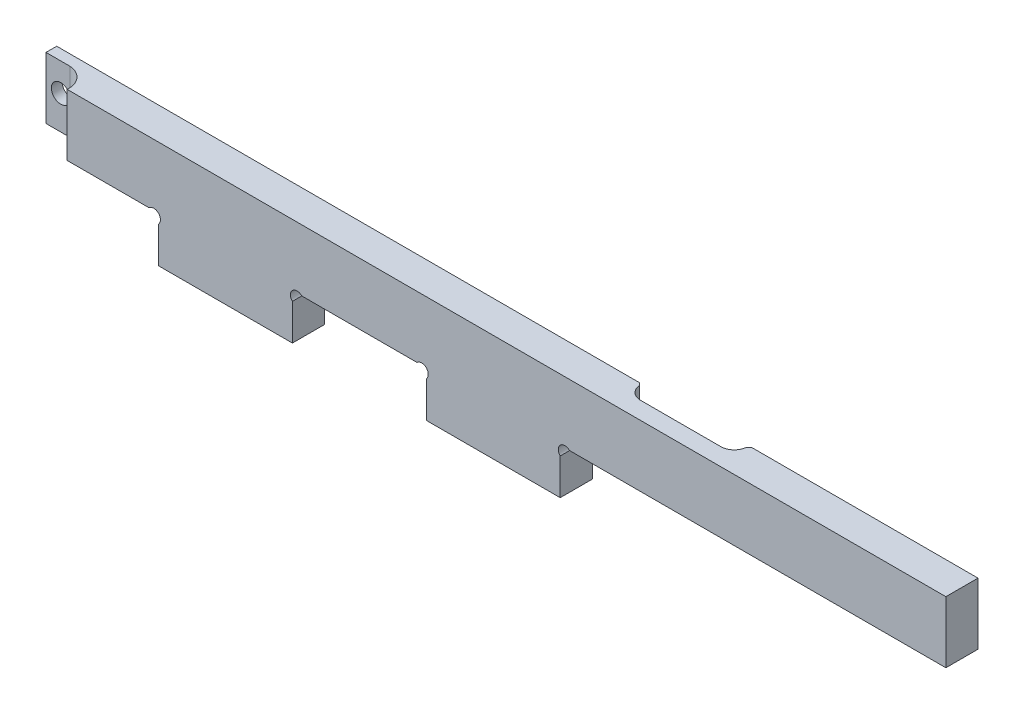
ISO-10303-21;
HEADER;
FILE_DESCRIPTION(('STEP AP214'),'2;1');
FILE_NAME('part.step','',(''),(''),'','','');
FILE_SCHEMA(('AUTOMOTIVE_DESIGN { 1 0 10303 214 1 1 1 1 }'));
ENDSEC;
DATA;
#1=APPLICATION_CONTEXT('core data for automotive mechanical design processes');
#2=APPLICATION_PROTOCOL_DEFINITION('international standard','automotive_design',2000,#1);
#3=PRODUCT_CONTEXT('',#1,'mechanical');
#4=PRODUCT('Part','Part','',(#3));
#5=PRODUCT_RELATED_PRODUCT_CATEGORY('part','',(#4));
#6=PRODUCT_DEFINITION_FORMATION('','',#4);
#7=PRODUCT_DEFINITION_CONTEXT('part definition',#1,'design');
#8=PRODUCT_DEFINITION('design','',#6,#7);
#9=PRODUCT_DEFINITION_SHAPE('','',#8);
#10=(LENGTH_UNIT() NAMED_UNIT(*) SI_UNIT(.MILLI.,.METRE.));
#11=(NAMED_UNIT(*) PLANE_ANGLE_UNIT() SI_UNIT($,.RADIAN.));
#12=(NAMED_UNIT(*) SI_UNIT($,.STERADIAN.) SOLID_ANGLE_UNIT());
#13=UNCERTAINTY_MEASURE_WITH_UNIT(LENGTH_MEASURE(1.E-05),#10,'distance_accuracy_value','');
#14=(GEOMETRIC_REPRESENTATION_CONTEXT(3) GLOBAL_UNCERTAINTY_ASSIGNED_CONTEXT((#13)) GLOBAL_UNIT_ASSIGNED_CONTEXT((#10,
#11,#12)) REPRESENTATION_CONTEXT('',''));
#15=CARTESIAN_POINT('',(0.,0.,0.));
#16=DIRECTION('',(0.,0.,1.));
#17=DIRECTION('',(1.,0.,0.));
#18=AXIS2_PLACEMENT_3D('',#15,#16,#17);
#19=CARTESIAN_POINT('',(-79.412979966611,24.8772522522521,0.));
#20=DIRECTION('',(0.,0.,-1.));
#21=DIRECTION('',(-1.,0.,0.));
#22=AXIS2_PLACEMENT_3D('',#19,#20,#21);
#23=PLANE('',#22);
#24=CARTESIAN_POINT('',(-122.162979966611,39.1272522522534,0.));
#25=DIRECTION('',(0.,0.,-1.));
#26=DIRECTION('',(-1.,0.,0.));
#27=AXIS2_PLACEMENT_3D('',#24,#25,#26);
#28=CIRCLE('',#27,3.50000000000001);
#29=CARTESIAN_POINT('',(-125.662979966611,39.1272522522534,0.));
#30=VERTEX_POINT('',#29);
#31=EDGE_CURVE('E208',#30,#30,#28,.T.);
#32=ORIENTED_EDGE('',*,*,#31,.F.);
#33=EDGE_LOOP('',(#32));
#34=FACE_BOUND('',#33,.T.);
#35=DIRECTION('',(-1.,0.,0.));
#36=VECTOR('',#35,1.);
#37=CARTESIAN_POINT('',(-127.662979966611,49.6272522522523,0.));
#38=LINE('',#37,#36);
#39=CARTESIAN_POINT('',(89.8578896618382,49.6272522522522,0.));
#40=VERTEX_POINT('',#39);
#41=CARTESIAN_POINT('',(-127.662979966611,49.6272522522523,0.));
#42=VERTEX_POINT('',#41);
#43=EDGE_CURVE('E222',#40,#42,#38,.T.);
#44=ORIENTED_EDGE('',*,*,#43,.F.);
#45=DIRECTION('',(0.,-1.,0.));
#46=VECTOR('',#45,1.);
#47=CARTESIAN_POINT('',(89.8578896618382,26.6272522522523,0.));
#48=LINE('',#47,#46);
#49=CARTESIAN_POINT('',(89.8578896618382,26.6272522522521,0.));
#50=VERTEX_POINT('',#49);
#51=EDGE_CURVE('E11',#40,#50,#48,.T.);
#52=ORIENTED_EDGE('',*,*,#51,.T.);
#53=DIRECTION('',(1.,0.,0.));
#54=VECTOR('',#53,1.);
#55=CARTESIAN_POINT('',(75.837020033389,26.6272522522521,0.));
#56=LINE('',#55,#54);
#57=CARTESIAN_POINT('',(75.837020033389,26.6272522522521,0.));
#58=VERTEX_POINT('',#57);
#59=EDGE_CURVE('E375',#58,#50,#56,.T.);
#60=ORIENTED_EDGE('',*,*,#59,.F.);
#61=CARTESIAN_POINT('',(74.087020033389,24.8772522522521,0.));
#62=DIRECTION('',(0.,0.,-1.));
#63=DIRECTION('',(1.,0.,0.));
#64=AXIS2_PLACEMENT_3D('',#61,#62,#63);
#65=CIRCLE('',#64,2.47487373415292);
#66=CARTESIAN_POINT('',(72.337020033389,23.1272522522521,0.));
#67=VERTEX_POINT('',#66);
#68=EDGE_CURVE('E372',#67,#58,#65,.T.);
#69=ORIENTED_EDGE('',*,*,#68,.F.);
#70=DIRECTION('',(0.,1.,0.));
#71=VECTOR('',#70,1.);
#72=CARTESIAN_POINT('',(72.337020033389,23.1272522522521,0.));
#73=LINE('',#72,#71);
#74=CARTESIAN_POINT('',(72.337020033389,9.6272522522523,0.));
#75=VERTEX_POINT('',#74);
#76=EDGE_CURVE('E370',#75,#67,#73,.T.);
#77=ORIENTED_EDGE('',*,*,#76,.F.);
#78=DIRECTION('',(1.,0.,0.));
#79=VECTOR('',#78,1.);
#80=CARTESIAN_POINT('',(22.337020033389,9.6272522522523,0.));
#81=LINE('',#80,#79);
#82=CARTESIAN_POINT('',(22.337020033389,9.6272522522523,0.));
#83=VERTEX_POINT('',#82);
#84=EDGE_CURVE('E368',#83,#75,#81,.T.);
#85=ORIENTED_EDGE('',*,*,#84,.F.);
#86=DIRECTION('',(0.,-1.,0.));
#87=VECTOR('',#86,1.);
#88=CARTESIAN_POINT('',(22.337020033389,23.1272522522521,0.));
#89=LINE('',#88,#87);
#90=CARTESIAN_POINT('',(22.337020033389,23.1272522522521,0.));
#91=VERTEX_POINT('',#90);
#92=EDGE_CURVE('E366',#91,#83,#89,.T.);
#93=ORIENTED_EDGE('',*,*,#92,.F.);
#94=CARTESIAN_POINT('',(20.587020033389,24.8772522522521,0.));
#95=DIRECTION('',(0.,0.,-1.));
#96=DIRECTION('',(-1.,0.,0.));
#97=AXIS2_PLACEMENT_3D('',#94,#95,#96);
#98=CIRCLE('',#97,2.47487373415292);
#99=CARTESIAN_POINT('',(18.837020033389,26.6272522522521,0.));
#100=VERTEX_POINT('',#99);
#101=EDGE_CURVE('E364',#100,#91,#98,.T.);
#102=ORIENTED_EDGE('',*,*,#101,.F.);
#103=DIRECTION('',(1.,0.,0.));
#104=VECTOR('',#103,1.);
#105=CARTESIAN_POINT('',(-24.162979966611,26.6272522522521,0.));
#106=LINE('',#105,#104);
#107=CARTESIAN_POINT('',(-24.162979966611,26.6272522522521,0.));
#108=VERTEX_POINT('',#107);
#109=EDGE_CURVE('E362',#108,#100,#106,.T.);
#110=ORIENTED_EDGE('',*,*,#109,.F.);
#111=CARTESIAN_POINT('',(-25.912979966611,24.8772522522521,0.));
#112=DIRECTION('',(0.,0.,-1.));
#113=DIRECTION('',(-1.,0.,0.));
#114=AXIS2_PLACEMENT_3D('',#111,#112,#113);
#115=CIRCLE('',#114,2.47487373415292);
#116=CARTESIAN_POINT('',(-27.662979966611,23.1272522522521,0.));
#117=VERTEX_POINT('',#116);
#118=EDGE_CURVE('E360',#117,#108,#115,.T.);
#119=ORIENTED_EDGE('',*,*,#118,.F.);
#120=DIRECTION('',(0.,1.,0.));
#121=VECTOR('',#120,1.);
#122=CARTESIAN_POINT('',(-27.662979966611,23.1272522522521,0.));
#123=LINE('',#122,#121);
#124=CARTESIAN_POINT('',(-27.662979966611,9.6272522522523,0.));
#125=VERTEX_POINT('',#124);
#126=EDGE_CURVE('E358',#125,#117,#123,.T.);
#127=ORIENTED_EDGE('',*,*,#126,.F.);
#128=DIRECTION('',(1.,0.,0.));
#129=VECTOR('',#128,1.);
#130=CARTESIAN_POINT('',(-77.662979966611,9.6272522522523,0.));
#131=LINE('',#130,#129);
#132=CARTESIAN_POINT('',(-77.662979966611,9.6272522522523,0.));
#133=VERTEX_POINT('',#132);
#134=EDGE_CURVE('E356',#133,#125,#131,.T.);
#135=ORIENTED_EDGE('',*,*,#134,.F.);
#136=DIRECTION('',(0.,-1.,0.));
#137=VECTOR('',#136,1.);
#138=CARTESIAN_POINT('',(-77.662979966611,23.1272522522521,0.));
#139=LINE('',#138,#137);
#140=CARTESIAN_POINT('',(-77.662979966611,23.1272522522521,0.));
#141=VERTEX_POINT('',#140);
#142=EDGE_CURVE('E354',#141,#133,#139,.T.);
#143=ORIENTED_EDGE('',*,*,#142,.F.);
#144=CARTESIAN_POINT('',(-79.412979966611,24.8772522522521,0.));
#145=DIRECTION('',(0.,0.,-1.));
#146=DIRECTION('',(-1.,0.,0.));
#147=AXIS2_PLACEMENT_3D('',#144,#145,#146);
#148=CIRCLE('',#147,2.47487373415292);
#149=CARTESIAN_POINT('',(-81.162979966611,26.6272522522521,0.));
#150=VERTEX_POINT('',#149);
#151=EDGE_CURVE('E352',#150,#141,#148,.T.);
#152=ORIENTED_EDGE('',*,*,#151,.F.);
#153=DIRECTION('',(1.,0.,0.));
#154=VECTOR('',#153,1.);
#155=CARTESIAN_POINT('',(-127.662979966611,26.6272522522523,0.));
#156=LINE('',#155,#154);
#157=CARTESIAN_POINT('',(-127.662979966611,26.6272522522523,0.));
#158=VERTEX_POINT('',#157);
#159=EDGE_CURVE('E350',#158,#150,#156,.T.);
#160=ORIENTED_EDGE('',*,*,#159,.F.);
#161=DIRECTION('',(0.,-1.,0.));
#162=VECTOR('',#161,1.);
#163=CARTESIAN_POINT('',(-127.662979966611,49.6272522522523,0.));
#164=LINE('',#163,#162);
#165=EDGE_CURVE('E316',#42,#158,#164,.T.);
#166=ORIENTED_EDGE('',*,*,#165,.F.);
#167=EDGE_LOOP('',(#44,#52,#60,#69,#77,#85,#93,#102,#110,#119,#127,#135,#143,#152,#160,#166));
#168=FACE_BOUND('',#167,.T.);
#169=ADVANCED_FACE('F32',(#34,#168),#23,.T.);
#170=CARTESIAN_POINT('',(-127.662979966611,49.6272522522523,12.));
#171=DIRECTION('',(1.,0.,0.));
#172=DIRECTION('',(0.,0.,-1.));
#173=AXIS2_PLACEMENT_3D('',#170,#171,#172);
#174=PLANE('',#173);
#175=DIRECTION('',(0.,0.,-1.));
#176=VECTOR('',#175,1.);
#177=CARTESIAN_POINT('',(-127.662979966611,26.6272522522523,12.));
#178=LINE('',#177,#176);
#179=CARTESIAN_POINT('',(-127.662979966611,26.6272522522523,4.));
#180=VERTEX_POINT('',#179);
#181=EDGE_CURVE('E217',#180,#158,#178,.T.);
#182=ORIENTED_EDGE('',*,*,#181,.F.);
#183=DIRECTION('',(0.,-1.,0.));
#184=VECTOR('',#183,1.);
#185=CARTESIAN_POINT('',(-127.662979966611,49.6272522522534,4.));
#186=LINE('',#185,#184);
#187=CARTESIAN_POINT('',(-127.662979966611,49.6272522522534,4.));
#188=VERTEX_POINT('',#187);
#189=EDGE_CURVE('E199',#188,#180,#186,.T.);
#190=ORIENTED_EDGE('',*,*,#189,.F.);
#191=DIRECTION('',(0.,0.,-1.));
#192=VECTOR('',#191,1.);
#193=CARTESIAN_POINT('',(-127.662979966611,49.6272522522523,12.));
#194=LINE('',#193,#192);
#195=EDGE_CURVE('E215',#188,#42,#194,.T.);
#196=ORIENTED_EDGE('',*,*,#195,.T.);
#197=ORIENTED_EDGE('',*,*,#165,.T.);
#198=EDGE_LOOP('',(#182,#190,#196,#197));
#199=FACE_BOUND('',#198,.T.);
#200=ADVANCED_FACE('F213',(#199),#174,.F.);
#201=CARTESIAN_POINT('',(-127.662979966611,26.6272522522523,12.));
#202=DIRECTION('',(0.,1.,0.));
#203=DIRECTION('',(-1.,0.,0.));
#204=AXIS2_PLACEMENT_3D('',#201,#202,#203);
#205=PLANE('',#204);
#206=DIRECTION('',(1.,0.,0.));
#207=VECTOR('',#206,1.);
#208=CARTESIAN_POINT('',(-127.662979966611,26.6272522522523,12.));
#209=LINE('',#208,#207);
#210=CARTESIAN_POINT('',(-111.742979966611,26.6272522522522,12.));
#211=VERTEX_POINT('',#210);
#212=CARTESIAN_POINT('',(-81.162979966611,26.6272522522521,12.));
#213=VERTEX_POINT('',#212);
#214=EDGE_CURVE('E322',#211,#213,#209,.T.);
#215=ORIENTED_EDGE('',*,*,#214,.F.);
#216=CARTESIAN_POINT('',(-119.202979966611,26.6272522522522,11.46));
#217=DIRECTION('',(0.,1.,0.));
#218=DIRECTION('',(-1.,0.,0.));
#219=AXIS2_PLACEMENT_3D('',#216,#217,#218);
#220=CIRCLE('',#219,7.47951870109303);
#221=CARTESIAN_POINT('',(-118.662979966611,26.6272522522523,4.));
#222=VERTEX_POINT('',#221);
#223=EDGE_CURVE('E318',#211,#222,#220,.T.);
#224=ORIENTED_EDGE('',*,*,#223,.T.);
#225=DIRECTION('',(-1.,0.,0.));
#226=VECTOR('',#225,1.);
#227=CARTESIAN_POINT('',(-127.662979966611,26.6272522522523,4.));
#228=LINE('',#227,#226);
#229=EDGE_CURVE('E313',#222,#180,#228,.T.);
#230=ORIENTED_EDGE('',*,*,#229,.T.);
#231=ORIENTED_EDGE('',*,*,#181,.T.);
#232=ORIENTED_EDGE('',*,*,#159,.T.);
#233=DIRECTION('',(0.,0.,-1.));
#234=VECTOR('',#233,1.);
#235=CARTESIAN_POINT('',(-81.162979966611,26.6272522522521,12.));
#236=LINE('',#235,#234);
#237=EDGE_CURVE('E271',#213,#150,#236,.T.);
#238=ORIENTED_EDGE('',*,*,#237,.F.);
#239=EDGE_LOOP('',(#215,#224,#230,#231,#232,#238));
#240=FACE_BOUND('',#239,.T.);
#241=ADVANCED_FACE('F413',(#240),#205,.F.);
#242=CARTESIAN_POINT('',(-79.412979966611,24.8772522522521,12.));
#243=DIRECTION('',(0.,0.,-1.));
#244=DIRECTION('',(-1.,0.,0.));
#245=AXIS2_PLACEMENT_3D('',#242,#243,#244);
#246=CYLINDRICAL_SURFACE('',#245,2.47487373415292);
#247=ORIENTED_EDGE('',*,*,#151,.T.);
#248=DIRECTION('',(0.,0.,-1.));
#249=VECTOR('',#248,1.);
#250=CARTESIAN_POINT('',(-77.662979966611,23.1272522522521,12.));
#251=LINE('',#250,#249);
#252=CARTESIAN_POINT('',(-77.662979966611,23.1272522522521,12.));
#253=VERTEX_POINT('',#252);
#254=EDGE_CURVE('E268',#253,#141,#251,.T.);
#255=ORIENTED_EDGE('',*,*,#254,.F.);
#256=CARTESIAN_POINT('',(-79.412979966611,24.8772522522521,12.));
#257=DIRECTION('',(0.,0.,-1.));
#258=DIRECTION('',(-1.,0.,0.));
#259=AXIS2_PLACEMENT_3D('',#256,#257,#258);
#260=CIRCLE('',#259,2.47487373415292);
#261=EDGE_CURVE('E324',#213,#253,#260,.T.);
#262=ORIENTED_EDGE('',*,*,#261,.F.);
#263=ORIENTED_EDGE('',*,*,#237,.T.);
#264=EDGE_LOOP('',(#247,#255,#262,#263));
#265=FACE_BOUND('',#264,.T.);
#266=ADVANCED_FACE('F464',(#265),#246,.F.);
#267=CARTESIAN_POINT('',(-77.662979966611,23.1272522522521,12.));
#268=DIRECTION('',(1.,0.,0.));
#269=DIRECTION('',(0.,0.,-1.));
#270=AXIS2_PLACEMENT_3D('',#267,#268,#269);
#271=PLANE('',#270);
#272=ORIENTED_EDGE('',*,*,#142,.T.);
#273=DIRECTION('',(0.,0.,-1.));
#274=VECTOR('',#273,1.);
#275=CARTESIAN_POINT('',(-77.662979966611,9.6272522522523,12.));
#276=LINE('',#275,#274);
#277=CARTESIAN_POINT('',(-77.662979966611,9.6272522522523,12.));
#278=VERTEX_POINT('',#277);
#279=EDGE_CURVE('E265',#278,#133,#276,.T.);
#280=ORIENTED_EDGE('',*,*,#279,.F.);
#281=DIRECTION('',(0.,-1.,0.));
#282=VECTOR('',#281,1.);
#283=CARTESIAN_POINT('',(-77.662979966611,23.1272522522521,12.));
#284=LINE('',#283,#282);
#285=EDGE_CURVE('E326',#253,#278,#284,.T.);
#286=ORIENTED_EDGE('',*,*,#285,.F.);
#287=ORIENTED_EDGE('',*,*,#254,.T.);
#288=EDGE_LOOP('',(#272,#280,#286,#287));
#289=FACE_BOUND('',#288,.T.);
#290=ADVANCED_FACE('F460',(#289),#271,.F.);
#291=CARTESIAN_POINT('',(-77.662979966611,9.6272522522523,12.));
#292=DIRECTION('',(0.,1.,0.));
#293=DIRECTION('',(0.,0.,1.));
#294=AXIS2_PLACEMENT_3D('',#291,#292,#293);
#295=PLANE('',#294);
#296=ORIENTED_EDGE('',*,*,#134,.T.);
#297=DIRECTION('',(0.,0.,-1.));
#298=VECTOR('',#297,1.);
#299=CARTESIAN_POINT('',(-27.662979966611,9.6272522522523,12.));
#300=LINE('',#299,#298);
#301=CARTESIAN_POINT('',(-27.662979966611,9.6272522522523,12.));
#302=VERTEX_POINT('',#301);
#303=EDGE_CURVE('E262',#302,#125,#300,.T.);
#304=ORIENTED_EDGE('',*,*,#303,.F.);
#305=DIRECTION('',(1.,0.,0.));
#306=VECTOR('',#305,1.);
#307=CARTESIAN_POINT('',(-77.662979966611,9.6272522522523,12.));
#308=LINE('',#307,#306);
#309=EDGE_CURVE('E328',#278,#302,#308,.T.);
#310=ORIENTED_EDGE('',*,*,#309,.F.);
#311=ORIENTED_EDGE('',*,*,#279,.T.);
#312=EDGE_LOOP('',(#296,#304,#310,#311));
#313=FACE_BOUND('',#312,.T.);
#314=ADVANCED_FACE('F456',(#313),#295,.F.);
#315=CARTESIAN_POINT('',(-27.662979966611,23.1272522522521,12.));
#316=DIRECTION('',(-1.,0.,0.));
#317=DIRECTION('',(0.,0.,1.));
#318=AXIS2_PLACEMENT_3D('',#315,#316,#317);
#319=PLANE('',#318);
#320=ORIENTED_EDGE('',*,*,#126,.T.);
#321=DIRECTION('',(0.,0.,-1.));
#322=VECTOR('',#321,1.);
#323=CARTESIAN_POINT('',(-27.662979966611,23.1272522522521,12.));
#324=LINE('',#323,#322);
#325=CARTESIAN_POINT('',(-27.662979966611,23.1272522522521,12.));
#326=VERTEX_POINT('',#325);
#327=EDGE_CURVE('E259',#326,#117,#324,.T.);
#328=ORIENTED_EDGE('',*,*,#327,.F.);
#329=DIRECTION('',(0.,1.,0.));
#330=VECTOR('',#329,1.);
#331=CARTESIAN_POINT('',(-27.662979966611,23.1272522522521,12.));
#332=LINE('',#331,#330);
#333=EDGE_CURVE('E330',#302,#326,#332,.T.);
#334=ORIENTED_EDGE('',*,*,#333,.F.);
#335=ORIENTED_EDGE('',*,*,#303,.T.);
#336=EDGE_LOOP('',(#320,#328,#334,#335));
#337=FACE_BOUND('',#336,.T.);
#338=ADVANCED_FACE('F452',(#337),#319,.F.);
#339=CARTESIAN_POINT('',(-25.912979966611,24.8772522522521,12.));
#340=DIRECTION('',(0.,0.,-1.));
#341=DIRECTION('',(-1.,0.,0.));
#342=AXIS2_PLACEMENT_3D('',#339,#340,#341);
#343=CYLINDRICAL_SURFACE('',#342,2.47487373415292);
#344=ORIENTED_EDGE('',*,*,#118,.T.);
#345=DIRECTION('',(0.,0.,-1.));
#346=VECTOR('',#345,1.);
#347=CARTESIAN_POINT('',(-24.162979966611,26.6272522522521,12.));
#348=LINE('',#347,#346);
#349=CARTESIAN_POINT('',(-24.162979966611,26.6272522522521,12.));
#350=VERTEX_POINT('',#349);
#351=EDGE_CURVE('E256',#350,#108,#348,.T.);
#352=ORIENTED_EDGE('',*,*,#351,.F.);
#353=CARTESIAN_POINT('',(-25.912979966611,24.8772522522521,12.));
#354=DIRECTION('',(0.,0.,-1.));
#355=DIRECTION('',(-1.,0.,0.));
#356=AXIS2_PLACEMENT_3D('',#353,#354,#355);
#357=CIRCLE('',#356,2.47487373415292);
#358=EDGE_CURVE('E332',#326,#350,#357,.T.);
#359=ORIENTED_EDGE('',*,*,#358,.F.);
#360=ORIENTED_EDGE('',*,*,#327,.T.);
#361=EDGE_LOOP('',(#344,#352,#359,#360));
#362=FACE_BOUND('',#361,.T.);
#363=ADVANCED_FACE('F448',(#362),#343,.F.);
#364=CARTESIAN_POINT('',(-24.162979966611,26.6272522522521,12.));
#365=DIRECTION('',(0.,1.,0.));
#366=DIRECTION('',(0.,0.,1.));
#367=AXIS2_PLACEMENT_3D('',#364,#365,#366);
#368=PLANE('',#367);
#369=ORIENTED_EDGE('',*,*,#109,.T.);
#370=DIRECTION('',(0.,0.,-1.));
#371=VECTOR('',#370,1.);
#372=CARTESIAN_POINT('',(18.837020033389,26.6272522522521,12.));
#373=LINE('',#372,#371);
#374=CARTESIAN_POINT('',(18.837020033389,26.6272522522521,12.));
#375=VERTEX_POINT('',#374);
#376=EDGE_CURVE('E253',#375,#100,#373,.T.);
#377=ORIENTED_EDGE('',*,*,#376,.F.);
#378=DIRECTION('',(1.,0.,0.));
#379=VECTOR('',#378,1.);
#380=CARTESIAN_POINT('',(-24.162979966611,26.6272522522521,12.));
#381=LINE('',#380,#379);
#382=EDGE_CURVE('E334',#350,#375,#381,.T.);
#383=ORIENTED_EDGE('',*,*,#382,.F.);
#384=ORIENTED_EDGE('',*,*,#351,.T.);
#385=EDGE_LOOP('',(#369,#377,#383,#384));
#386=FACE_BOUND('',#385,.T.);
#387=ADVANCED_FACE('F444',(#386),#368,.F.);
#388=CARTESIAN_POINT('',(20.587020033389,24.8772522522521,12.));
#389=DIRECTION('',(0.,0.,-1.));
#390=DIRECTION('',(-1.,0.,0.));
#391=AXIS2_PLACEMENT_3D('',#388,#389,#390);
#392=CYLINDRICAL_SURFACE('',#391,2.47487373415292);
#393=ORIENTED_EDGE('',*,*,#101,.T.);
#394=DIRECTION('',(0.,0.,-1.));
#395=VECTOR('',#394,1.);
#396=CARTESIAN_POINT('',(22.337020033389,23.1272522522521,12.));
#397=LINE('',#396,#395);
#398=CARTESIAN_POINT('',(22.337020033389,23.1272522522521,12.));
#399=VERTEX_POINT('',#398);
#400=EDGE_CURVE('E250',#399,#91,#397,.T.);
#401=ORIENTED_EDGE('',*,*,#400,.F.);
#402=CARTESIAN_POINT('',(20.587020033389,24.8772522522521,12.));
#403=DIRECTION('',(0.,0.,-1.));
#404=DIRECTION('',(-1.,0.,0.));
#405=AXIS2_PLACEMENT_3D('',#402,#403,#404);
#406=CIRCLE('',#405,2.47487373415292);
#407=EDGE_CURVE('E336',#375,#399,#406,.T.);
#408=ORIENTED_EDGE('',*,*,#407,.F.);
#409=ORIENTED_EDGE('',*,*,#376,.T.);
#410=EDGE_LOOP('',(#393,#401,#408,#409));
#411=FACE_BOUND('',#410,.T.);
#412=ADVANCED_FACE('F440',(#411),#392,.F.);
#413=CARTESIAN_POINT('',(22.337020033389,23.1272522522521,12.));
#414=DIRECTION('',(1.,0.,0.));
#415=DIRECTION('',(0.,1.,0.));
#416=AXIS2_PLACEMENT_3D('',#413,#414,#415);
#417=PLANE('',#416);
#418=ORIENTED_EDGE('',*,*,#92,.T.);
#419=DIRECTION('',(0.,0.,-1.));
#420=VECTOR('',#419,1.);
#421=CARTESIAN_POINT('',(22.337020033389,9.6272522522523,12.));
#422=LINE('',#421,#420);
#423=CARTESIAN_POINT('',(22.337020033389,9.6272522522523,12.));
#424=VERTEX_POINT('',#423);
#425=EDGE_CURVE('E247',#424,#83,#422,.T.);
#426=ORIENTED_EDGE('',*,*,#425,.F.);
#427=DIRECTION('',(0.,-1.,0.));
#428=VECTOR('',#427,1.);
#429=CARTESIAN_POINT('',(22.337020033389,23.1272522522521,12.));
#430=LINE('',#429,#428);
#431=EDGE_CURVE('E338',#399,#424,#430,.T.);
#432=ORIENTED_EDGE('',*,*,#431,.F.);
#433=ORIENTED_EDGE('',*,*,#400,.T.);
#434=EDGE_LOOP('',(#418,#426,#432,#433));
#435=FACE_BOUND('',#434,.T.);
#436=ADVANCED_FACE('F436',(#435),#417,.F.);
#437=CARTESIAN_POINT('',(22.337020033389,9.6272522522523,12.));
#438=DIRECTION('',(0.,1.,0.));
#439=DIRECTION('',(0.,0.,1.));
#440=AXIS2_PLACEMENT_3D('',#437,#438,#439);
#441=PLANE('',#440);
#442=ORIENTED_EDGE('',*,*,#84,.T.);
#443=DIRECTION('',(0.,0.,-1.));
#444=VECTOR('',#443,1.);
#445=CARTESIAN_POINT('',(72.337020033389,9.6272522522523,12.));
#446=LINE('',#445,#444);
#447=CARTESIAN_POINT('',(72.337020033389,9.6272522522523,12.));
#448=VERTEX_POINT('',#447);
#449=EDGE_CURVE('E244',#448,#75,#446,.T.);
#450=ORIENTED_EDGE('',*,*,#449,.F.);
#451=DIRECTION('',(1.,0.,0.));
#452=VECTOR('',#451,1.);
#453=CARTESIAN_POINT('',(22.337020033389,9.6272522522523,12.));
#454=LINE('',#453,#452);
#455=EDGE_CURVE('E340',#424,#448,#454,.T.);
#456=ORIENTED_EDGE('',*,*,#455,.F.);
#457=ORIENTED_EDGE('',*,*,#425,.T.);
#458=EDGE_LOOP('',(#442,#450,#456,#457));
#459=FACE_BOUND('',#458,.T.);
#460=ADVANCED_FACE('F432',(#459),#441,.F.);
#461=CARTESIAN_POINT('',(72.337020033389,23.1272522522521,12.));
#462=DIRECTION('',(-1.,0.,0.));
#463=DIRECTION('',(0.,0.,1.));
#464=AXIS2_PLACEMENT_3D('',#461,#462,#463);
#465=PLANE('',#464);
#466=ORIENTED_EDGE('',*,*,#76,.T.);
#467=DIRECTION('',(0.,0.,-1.));
#468=VECTOR('',#467,1.);
#469=CARTESIAN_POINT('',(72.337020033389,23.1272522522521,12.));
#470=LINE('',#469,#468);
#471=CARTESIAN_POINT('',(72.337020033389,23.1272522522521,12.));
#472=VERTEX_POINT('',#471);
#473=EDGE_CURVE('E241',#472,#67,#470,.T.);
#474=ORIENTED_EDGE('',*,*,#473,.F.);
#475=DIRECTION('',(0.,1.,0.));
#476=VECTOR('',#475,1.);
#477=CARTESIAN_POINT('',(72.337020033389,23.1272522522521,12.));
#478=LINE('',#477,#476);
#479=EDGE_CURVE('E342',#448,#472,#478,.T.);
#480=ORIENTED_EDGE('',*,*,#479,.F.);
#481=ORIENTED_EDGE('',*,*,#449,.T.);
#482=EDGE_LOOP('',(#466,#474,#480,#481));
#483=FACE_BOUND('',#482,.T.);
#484=ADVANCED_FACE('F428',(#483),#465,.F.);
#485=CARTESIAN_POINT('',(74.087020033389,24.8772522522521,12.));
#486=DIRECTION('',(0.,0.,-1.));
#487=DIRECTION('',(-1.,0.,0.));
#488=AXIS2_PLACEMENT_3D('',#485,#486,#487);
#489=CYLINDRICAL_SURFACE('',#488,2.47487373415292);
#490=ORIENTED_EDGE('',*,*,#68,.T.);
#491=DIRECTION('',(0.,0.,-1.));
#492=VECTOR('',#491,1.);
#493=CARTESIAN_POINT('',(75.837020033389,26.6272522522521,12.));
#494=LINE('',#493,#492);
#495=CARTESIAN_POINT('',(75.837020033389,26.6272522522521,12.));
#496=VERTEX_POINT('',#495);
#497=EDGE_CURVE('E238',#496,#58,#494,.T.);
#498=ORIENTED_EDGE('',*,*,#497,.F.);
#499=CARTESIAN_POINT('',(74.087020033389,24.8772522522521,12.));
#500=DIRECTION('',(0.,0.,-1.));
#501=DIRECTION('',(1.,0.,0.));
#502=AXIS2_PLACEMENT_3D('',#499,#500,#501);
#503=CIRCLE('',#502,2.47487373415292);
#504=EDGE_CURVE('E344',#472,#496,#503,.T.);
#505=ORIENTED_EDGE('',*,*,#504,.F.);
#506=ORIENTED_EDGE('',*,*,#473,.T.);
#507=EDGE_LOOP('',(#490,#498,#505,#506));
#508=FACE_BOUND('',#507,.T.);
#509=ADVANCED_FACE('F425',(#508),#489,.F.);
#510=CARTESIAN_POINT('',(75.837020033389,26.6272522522521,12.));
#511=DIRECTION('',(0.,1.,0.));
#512=DIRECTION('',(-1.,0.,0.));
#513=AXIS2_PLACEMENT_3D('',#510,#511,#512);
#514=PLANE('',#513);
#515=CARTESIAN_POINT('',(125.837020033389,26.6272522522521,0.5));
#516=DIRECTION('',(0.,1.,0.));
#517=DIRECTION('',(-1.,0.,0.));
#518=AXIS2_PLACEMENT_3D('',#515,#516,#517);
#519=CIRCLE('',#518,5.);
#520=CARTESIAN_POINT('',(125.837020033389,26.6272522522523,5.5));
#521=VERTEX_POINT('',#520);
#522=CARTESIAN_POINT('',(130.819628676348,26.6272522522521,0.916666666666675));
#523=VERTEX_POINT('',#522);
#524=EDGE_CURVE('E281',#521,#523,#519,.T.);
#525=ORIENTED_EDGE('',*,*,#524,.T.);
#526=DIRECTION('',(-0.735980072193987,0.,0.67700320038633));
#527=VECTOR('',#526,1.);
#528=CARTESIAN_POINT('',(130.819628676348,26.6272522522521,0.916666666666683));
#529=LINE('',#528,#527);
#530=CARTESIAN_POINT('',(131.81615040494,26.6272522522521,0.));
#531=VERTEX_POINT('',#530);
#532=EDGE_CURVE('E295',#523,#531,#529,.F.);
#533=ORIENTED_EDGE('',*,*,#532,.T.);
#534=CARTESIAN_POINT('',(216.337020033389,26.6272522522521,0.));
#535=VERTEX_POINT('',#534);
#536=EDGE_CURVE('E374',#531,#535,#56,.T.);
#537=ORIENTED_EDGE('',*,*,#536,.T.);
#538=DIRECTION('',(0.,0.,-1.));
#539=VECTOR('',#538,1.);
#540=CARTESIAN_POINT('',(216.337020033389,26.6272522522521,12.));
#541=LINE('',#540,#539);
#542=CARTESIAN_POINT('',(216.337020033389,26.6272522522521,12.));
#543=VERTEX_POINT('',#542);
#544=EDGE_CURVE('E227',#543,#535,#541,.T.);
#545=ORIENTED_EDGE('',*,*,#544,.F.);
#546=DIRECTION('',(1.,0.,0.));
#547=VECTOR('',#546,1.);
#548=CARTESIAN_POINT('',(75.837020033389,26.6272522522521,12.));
#549=LINE('',#548,#547);
#550=EDGE_CURVE('E346',#496,#543,#549,.T.);
#551=ORIENTED_EDGE('',*,*,#550,.F.);
#552=ORIENTED_EDGE('',*,*,#497,.T.);
#553=ORIENTED_EDGE('',*,*,#59,.T.);
#554=DIRECTION('',(-0.735980072193987,0.,-0.67700320038633));
#555=VECTOR('',#554,1.);
#556=CARTESIAN_POINT('',(90.85441139043,26.6272522522521,0.916666666666679));
#557=LINE('',#556,#555);
#558=CARTESIAN_POINT('',(90.85441139043,26.6272522522521,0.916666666666673));
#559=VERTEX_POINT('',#558);
#560=EDGE_CURVE('E293',#50,#559,#557,.F.);
#561=ORIENTED_EDGE('',*,*,#560,.T.);
#562=CARTESIAN_POINT('',(95.8370200333889,26.6272522522521,0.5));
#563=DIRECTION('',(0.,1.,0.));
#564=DIRECTION('',(-1.,0.,0.));
#565=AXIS2_PLACEMENT_3D('',#562,#563,#564);
#566=CIRCLE('',#565,5.);
#567=CARTESIAN_POINT('',(95.8370200333889,26.6272522522523,5.5));
#568=VERTEX_POINT('',#567);
#569=EDGE_CURVE('E288',#559,#568,#566,.T.);
#570=ORIENTED_EDGE('',*,*,#569,.T.);
#571=DIRECTION('',(-1.,0.,0.));
#572=VECTOR('',#571,1.);
#573=CARTESIAN_POINT('',(130.837020033389,26.6272522522523,5.5));
#574=LINE('',#573,#572);
#575=EDGE_CURVE('E312',#521,#568,#574,.T.);
#576=ORIENTED_EDGE('',*,*,#575,.F.);
#577=EDGE_LOOP('',(#525,#533,#537,#545,#551,#552,#553,#561,#570,#576));
#578=FACE_BOUND('',#577,.T.);
#579=ADVANCED_FACE('F393',(#578),#514,.F.);
#580=CARTESIAN_POINT('',(216.337020033389,26.6272522522521,12.));
#581=DIRECTION('',(-1.,0.,0.));
#582=DIRECTION('',(0.,-1.,0.));
#583=AXIS2_PLACEMENT_3D('',#580,#581,#582);
#584=PLANE('',#583);
#585=DIRECTION('',(0.,1.,0.));
#586=VECTOR('',#585,1.);
#587=CARTESIAN_POINT('',(216.337020033389,26.6272522522521,0.));
#588=LINE('',#587,#586);
#589=CARTESIAN_POINT('',(216.337020033389,49.6272522522521,0.));
#590=VERTEX_POINT('',#589);
#591=EDGE_CURVE('E377',#535,#590,#588,.T.);
#592=ORIENTED_EDGE('',*,*,#591,.T.);
#593=DIRECTION('',(0.,0.,-1.));
#594=VECTOR('',#593,1.);
#595=CARTESIAN_POINT('',(216.337020033389,49.6272522522521,12.));
#596=LINE('',#595,#594);
#597=CARTESIAN_POINT('',(216.337020033389,49.6272522522521,12.));
#598=VERTEX_POINT('',#597);
#599=EDGE_CURVE('E223',#598,#590,#596,.T.);
#600=ORIENTED_EDGE('',*,*,#599,.F.);
#601=DIRECTION('',(0.,1.,0.));
#602=VECTOR('',#601,1.);
#603=CARTESIAN_POINT('',(216.337020033389,26.6272522522521,12.));
#604=LINE('',#603,#602);
#605=EDGE_CURVE('E230',#543,#598,#604,.T.);
#606=ORIENTED_EDGE('',*,*,#605,.F.);
#607=ORIENTED_EDGE('',*,*,#544,.T.);
#608=EDGE_LOOP('',(#592,#600,#606,#607));
#609=FACE_BOUND('',#608,.T.);
#610=ADVANCED_FACE('F420',(#609),#584,.F.);
#611=CARTESIAN_POINT('',(-127.662979966611,49.6272522522523,12.));
#612=DIRECTION('',(0.,-1.,0.));
#613=DIRECTION('',(1.,0.,0.));
#614=AXIS2_PLACEMENT_3D('',#611,#612,#613);
#615=PLANE('',#614);
#616=CARTESIAN_POINT('',(131.81615040494,49.6272522522521,0.));
#617=VERTEX_POINT('',#616);
#618=EDGE_CURVE('E233',#590,#617,#38,.T.);
#619=ORIENTED_EDGE('',*,*,#618,.T.);
#620=DIRECTION('',(0.735980072193987,0.,-0.67700320038633));
#621=VECTOR('',#620,1.);
#622=CARTESIAN_POINT('',(130.819628676348,49.6272522522521,0.916666666666669));
#623=LINE('',#622,#621);
#624=CARTESIAN_POINT('',(130.819628676348,49.6272522522521,0.916666666666675));
#625=VERTEX_POINT('',#624);
#626=EDGE_CURVE('E300',#617,#625,#623,.F.);
#627=ORIENTED_EDGE('',*,*,#626,.T.);
#628=CARTESIAN_POINT('',(125.837020033389,49.6272522522521,0.5));
#629=DIRECTION('',(0.,-1.,0.));
#630=DIRECTION('',(1.,0.,0.));
#631=AXIS2_PLACEMENT_3D('',#628,#629,#630);
#632=CIRCLE('',#631,5.);
#633=CARTESIAN_POINT('',(125.837020033389,49.6272522522521,5.5));
#634=VERTEX_POINT('',#633);
#635=EDGE_CURVE('E284',#625,#634,#632,.T.);
#636=ORIENTED_EDGE('',*,*,#635,.T.);
#637=DIRECTION('',(1.,0.,0.));
#638=VECTOR('',#637,1.);
#639=CARTESIAN_POINT('',(130.837020033389,49.6272522522521,5.5));
#640=LINE('',#639,#638);
#641=CARTESIAN_POINT('',(95.8370200333889,49.6272522522521,5.5));
#642=VERTEX_POINT('',#641);
#643=EDGE_CURVE('E308',#642,#634,#640,.T.);
#644=ORIENTED_EDGE('',*,*,#643,.F.);
#645=CARTESIAN_POINT('',(95.8370200333889,49.6272522522522,0.5));
#646=DIRECTION('',(0.,-1.,0.));
#647=DIRECTION('',(1.,0.,0.));
#648=AXIS2_PLACEMENT_3D('',#645,#646,#647);
#649=CIRCLE('',#648,5.);
#650=CARTESIAN_POINT('',(90.85441139043,49.6272522522522,0.916666666666673));
#651=VERTEX_POINT('',#650);
#652=EDGE_CURVE('E286',#642,#651,#649,.T.);
#653=ORIENTED_EDGE('',*,*,#652,.T.);
#654=DIRECTION('',(0.735980072193987,0.,0.67700320038633));
#655=VECTOR('',#654,1.);
#656=CARTESIAN_POINT('',(90.85441139043,49.6272522522522,0.916666666666693));
#657=LINE('',#656,#655);
#658=EDGE_CURVE('E47',#651,#40,#657,.F.);
#659=ORIENTED_EDGE('',*,*,#658,.T.);
#660=ORIENTED_EDGE('',*,*,#43,.T.);
#661=ORIENTED_EDGE('',*,*,#195,.F.);
#662=DIRECTION('',(1.,0.,0.));
#663=VECTOR('',#662,1.);
#664=CARTESIAN_POINT('',(-118.662979966611,49.6272522522534,4.));
#665=LINE('',#664,#663);
#666=CARTESIAN_POINT('',(-118.662979966611,49.6272522522534,4.));
#667=VERTEX_POINT('',#666);
#668=EDGE_CURVE('E194',#188,#667,#665,.T.);
#669=ORIENTED_EDGE('',*,*,#668,.T.);
#670=CARTESIAN_POINT('',(-119.202979966611,49.6272522522534,11.46));
#671=DIRECTION('',(0.,-1.,0.));
#672=DIRECTION('',(1.,0.,0.));
#673=AXIS2_PLACEMENT_3D('',#670,#671,#672);
#674=CIRCLE('',#673,7.47951870109303);
#675=CARTESIAN_POINT('',(-111.742979966611,49.6272522522534,12.));
#676=VERTEX_POINT('',#675);
#677=EDGE_CURVE('E207',#667,#676,#674,.T.);
#678=ORIENTED_EDGE('',*,*,#677,.T.);
#679=DIRECTION('',(-1.,0.,0.));
#680=VECTOR('',#679,1.);
#681=CARTESIAN_POINT('',(-127.662979966611,49.6272522522523,12.));
#682=LINE('',#681,#680);
#683=EDGE_CURVE('E224',#598,#676,#682,.T.);
#684=ORIENTED_EDGE('',*,*,#683,.F.);
#685=ORIENTED_EDGE('',*,*,#599,.T.);
#686=EDGE_LOOP('',(#619,#627,#636,#644,#653,#659,#660,#661,#669,#678,#684,#685));
#687=FACE_BOUND('',#686,.T.);
#688=ADVANCED_FACE('F221',(#687),#615,.F.);
#689=CARTESIAN_POINT('',(-79.412979966611,24.8772522522521,12.));
#690=DIRECTION('',(0.,0.,-1.));
#691=DIRECTION('',(-1.,0.,0.));
#692=AXIS2_PLACEMENT_3D('',#689,#690,#691);
#693=PLANE('',#692);
#694=ORIENTED_EDGE('',*,*,#683,.T.);
#695=DIRECTION('',(0.,-1.,0.));
#696=VECTOR('',#695,1.);
#697=CARTESIAN_POINT('',(-111.742979966611,49.6272522522534,12.));
#698=LINE('',#697,#696);
#699=EDGE_CURVE('E581',#676,#211,#698,.T.);
#700=ORIENTED_EDGE('',*,*,#699,.T.);
#701=ORIENTED_EDGE('',*,*,#214,.T.);
#702=ORIENTED_EDGE('',*,*,#261,.T.);
#703=ORIENTED_EDGE('',*,*,#285,.T.);
#704=ORIENTED_EDGE('',*,*,#309,.T.);
#705=ORIENTED_EDGE('',*,*,#333,.T.);
#706=ORIENTED_EDGE('',*,*,#358,.T.);
#707=ORIENTED_EDGE('',*,*,#382,.T.);
#708=ORIENTED_EDGE('',*,*,#407,.T.);
#709=ORIENTED_EDGE('',*,*,#431,.T.);
#710=ORIENTED_EDGE('',*,*,#455,.T.);
#711=ORIENTED_EDGE('',*,*,#479,.T.);
#712=ORIENTED_EDGE('',*,*,#504,.T.);
#713=ORIENTED_EDGE('',*,*,#550,.T.);
#714=ORIENTED_EDGE('',*,*,#605,.T.);
#715=EDGE_LOOP('',(#694,#700,#701,#702,#703,#704,#705,#706,#707,#708,#709,#710,#711,#712,#713,#714));
#716=FACE_BOUND('',#715,.T.);
#717=ADVANCED_FACE('F404',(#716),#693,.F.);
#718=ORIENTED_EDGE('',*,*,#536,.F.);
#719=DIRECTION('',(0.,1.,0.));
#720=VECTOR('',#719,1.);
#721=CARTESIAN_POINT('',(131.81615040494,49.6272522522521,0.));
#722=LINE('',#721,#720);
#723=EDGE_CURVE('E297',#531,#617,#722,.T.);
#724=ORIENTED_EDGE('',*,*,#723,.T.);
#725=ORIENTED_EDGE('',*,*,#618,.F.);
#726=ORIENTED_EDGE('',*,*,#591,.F.);
#727=EDGE_LOOP('',(#718,#724,#725,#726));
#728=FACE_BOUND('',#727,.T.);
#729=ADVANCED_FACE('F397',(#728),#23,.T.);
#730=CARTESIAN_POINT('',(0.,0.,5.5));
#731=DIRECTION('',(0.,0.,-1.));
#732=DIRECTION('',(-1.,0.,0.));
#733=AXIS2_PLACEMENT_3D('',#730,#731,#732);
#734=PLANE('',#733);
#735=ORIENTED_EDGE('',*,*,#643,.T.);
#736=DIRECTION('',(0.,-1.,0.));
#737=VECTOR('',#736,1.);
#738=CARTESIAN_POINT('',(125.837020033389,0.,5.5));
#739=LINE('',#738,#737);
#740=EDGE_CURVE('E278',#634,#521,#739,.T.);
#741=ORIENTED_EDGE('',*,*,#740,.T.);
#742=ORIENTED_EDGE('',*,*,#575,.T.);
#743=DIRECTION('',(0.,1.,0.));
#744=VECTOR('',#743,1.);
#745=CARTESIAN_POINT('',(95.8370200333889,0.,5.5));
#746=LINE('',#745,#744);
#747=EDGE_CURVE('E275',#568,#642,#746,.T.);
#748=ORIENTED_EDGE('',*,*,#747,.T.);
#749=EDGE_LOOP('',(#735,#741,#742,#748));
#750=FACE_BOUND('',#749,.T.);
#751=ADVANCED_FACE('F395',(#750),#734,.T.);
#752=CARTESIAN_POINT('',(125.837020033389,0.,0.5));
#753=DIRECTION('',(0.,-1.,0.));
#754=DIRECTION('',(0.,0.,-1.));
#755=AXIS2_PLACEMENT_3D('',#752,#753,#754);
#756=CYLINDRICAL_SURFACE('',#755,5.);
#757=ORIENTED_EDGE('',*,*,#635,.F.);
#758=DIRECTION('',(0.,-1.,0.));
#759=VECTOR('',#758,1.);
#760=CARTESIAN_POINT('',(130.819628676348,0.,0.916666666666675));
#761=LINE('',#760,#759);
#762=EDGE_CURVE('E290',#625,#523,#761,.T.);
#763=ORIENTED_EDGE('',*,*,#762,.T.);
#764=ORIENTED_EDGE('',*,*,#524,.F.);
#765=ORIENTED_EDGE('',*,*,#740,.F.);
#766=EDGE_LOOP('',(#757,#763,#764,#765));
#767=FACE_BOUND('',#766,.T.);
#768=ADVANCED_FACE('F390',(#767),#756,.F.);
#769=CARTESIAN_POINT('',(95.8370200333889,0.,0.5));
#770=DIRECTION('',(0.,1.,0.));
#771=DIRECTION('',(0.,0.,1.));
#772=AXIS2_PLACEMENT_3D('',#769,#770,#771);
#773=CYLINDRICAL_SURFACE('',#772,5.);
#774=ORIENTED_EDGE('',*,*,#569,.F.);
#775=DIRECTION('',(0.,1.,0.));
#776=VECTOR('',#775,1.);
#777=CARTESIAN_POINT('',(90.85441139043,0.,0.916666666666673));
#778=LINE('',#777,#776);
#779=EDGE_CURVE('E40',#559,#651,#778,.T.);
#780=ORIENTED_EDGE('',*,*,#779,.T.);
#781=ORIENTED_EDGE('',*,*,#652,.F.);
#782=ORIENTED_EDGE('',*,*,#747,.F.);
#783=EDGE_LOOP('',(#774,#780,#781,#782));
#784=FACE_BOUND('',#783,.T.);
#785=ADVANCED_FACE('F303',(#784),#773,.F.);
#786=CARTESIAN_POINT('',(-118.662979966611,49.6272522522534,4.));
#787=DIRECTION('',(0.,0.,-1.));
#788=DIRECTION('',(-1.,0.,0.));
#789=AXIS2_PLACEMENT_3D('',#786,#787,#788);
#790=PLANE('',#789);
#791=DIRECTION('',(0.,-1.,0.));
#792=VECTOR('',#791,1.);
#793=CARTESIAN_POINT('',(-118.662979966611,49.6272522522534,4.));
#794=LINE('',#793,#792);
#795=CARTESIAN_POINT('',(-118.662979966611,39.1272522522534,4.));
#796=VERTEX_POINT('',#795);
#797=EDGE_CURVE('E218',#796,#222,#794,.T.);
#798=ORIENTED_EDGE('',*,*,#797,.F.);
#799=CARTESIAN_POINT('',(-122.162979966611,39.1272522522534,4.));
#800=DIRECTION('',(0.,0.,-1.));
#801=DIRECTION('',(-1.,0.,0.));
#802=AXIS2_PLACEMENT_3D('',#799,#800,#801);
#803=CIRCLE('',#802,3.50000000000001);
#804=EDGE_CURVE('E590',#796,#796,#803,.T.);
#805=ORIENTED_EDGE('',*,*,#804,.T.);
#806=EDGE_CURVE('E203',#667,#796,#794,.T.);
#807=ORIENTED_EDGE('',*,*,#806,.F.);
#808=ORIENTED_EDGE('',*,*,#668,.F.);
#809=ORIENTED_EDGE('',*,*,#189,.T.);
#810=ORIENTED_EDGE('',*,*,#229,.F.);
#811=EDGE_LOOP('',(#798,#805,#807,#808,#809,#810));
#812=FACE_BOUND('',#811,.T.);
#813=ADVANCED_FACE('F197',(#812),#790,.F.);
#814=CARTESIAN_POINT('',(-119.202979966611,49.6272522522534,11.46));
#815=DIRECTION('',(0.,-1.,0.));
#816=DIRECTION('',(1.,0.,0.));
#817=AXIS2_PLACEMENT_3D('',#814,#815,#816);
#818=CYLINDRICAL_SURFACE('',#817,7.47951870109303);
#819=ORIENTED_EDGE('',*,*,#699,.F.);
#820=ORIENTED_EDGE('',*,*,#677,.F.);
#821=ORIENTED_EDGE('',*,*,#806,.T.);
#822=ORIENTED_EDGE('',*,*,#797,.T.);
#823=ORIENTED_EDGE('',*,*,#223,.F.);
#824=EDGE_LOOP('',(#819,#820,#821,#822,#823));
#825=FACE_BOUND('',#824,.T.);
#826=ADVANCED_FACE('F479',(#825),#818,.F.);
#827=CARTESIAN_POINT('',(-122.162979966611,39.1272522522534,-5.99999999999998));
#828=DIRECTION('',(0.,0.,1.));
#829=DIRECTION('',(1.,0.,0.));
#830=AXIS2_PLACEMENT_3D('',#827,#828,#829);
#831=CYLINDRICAL_SURFACE('',#830,3.50000000000001);
#832=ORIENTED_EDGE('',*,*,#31,.T.);
#833=EDGE_LOOP('',(#832));
#834=FACE_BOUND('',#833,.T.);
#835=ORIENTED_EDGE('',*,*,#804,.F.);
#836=EDGE_LOOP('',(#835));
#837=FACE_BOUND('',#836,.T.);
#838=ADVANCED_FACE('F474',(#834,#837),#831,.F.);
#839=CARTESIAN_POINT('',(130.819628676348,0.,0.916666666666681));
#840=DIRECTION('',(0.67700320038633,0.,0.735980072193987));
#841=DIRECTION('',(0.,-1.,0.));
#842=AXIS2_PLACEMENT_3D('',#839,#840,#841);
#843=PLANE('',#842);
#844=ORIENTED_EDGE('',*,*,#626,.F.);
#845=ORIENTED_EDGE('',*,*,#723,.F.);
#846=ORIENTED_EDGE('',*,*,#532,.F.);
#847=ORIENTED_EDGE('',*,*,#762,.F.);
#848=EDGE_LOOP('',(#844,#845,#846,#847));
#849=FACE_BOUND('',#848,.T.);
#850=ADVANCED_FACE('F388',(#849),#843,.F.);
#851=CARTESIAN_POINT('',(90.85441139043,0.,0.916666666666681));
#852=DIRECTION('',(-0.67700320038633,0.,0.735980072193987));
#853=DIRECTION('',(0.,1.,0.));
#854=AXIS2_PLACEMENT_3D('',#851,#852,#853);
#855=PLANE('',#854);
#856=ORIENTED_EDGE('',*,*,#560,.F.);
#857=ORIENTED_EDGE('',*,*,#51,.F.);
#858=ORIENTED_EDGE('',*,*,#658,.F.);
#859=ORIENTED_EDGE('',*,*,#779,.F.);
#860=EDGE_LOOP('',(#856,#857,#858,#859));
#861=FACE_BOUND('',#860,.T.);
#862=ADVANCED_FACE('F34',(#861),#855,.F.);
#863=CLOSED_SHELL('',(#169,#200,#241,#266,#290,#314,#338,#363,#387,#412,#436,#460,#484,#509,
#579,#610,#688,#717,#729,#751,#768,#785,#813,#826,#838,#850,#862));
#864=MANIFOLD_SOLID_BREP('B2',#863);
#865=ADVANCED_BREP_SHAPE_REPRESENTATION('',(#18,#864),#14);
#866=SHAPE_DEFINITION_REPRESENTATION(#9,#865);
ENDSEC;
END-ISO-10303-21;
